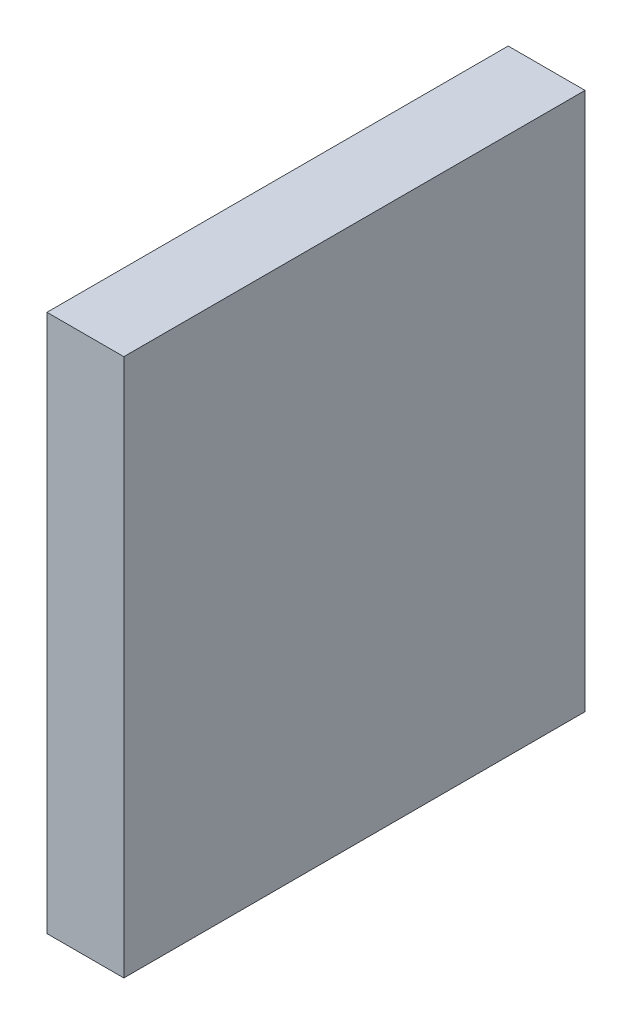
ISO-10303-21;
HEADER;
FILE_DESCRIPTION(('STEP AP214'),'2;1');
FILE_NAME('part.step','',(''),(''),'','','');
FILE_SCHEMA(('AUTOMOTIVE_DESIGN { 1 0 10303 214 1 1 1 1 }'));
ENDSEC;
DATA;
#1=APPLICATION_CONTEXT('core data for automotive mechanical design processes');
#2=APPLICATION_PROTOCOL_DEFINITION('international standard','automotive_design',2000,#1);
#3=PRODUCT_CONTEXT('',#1,'mechanical');
#4=PRODUCT('Part','Part','',(#3));
#5=PRODUCT_RELATED_PRODUCT_CATEGORY('part','',(#4));
#6=PRODUCT_DEFINITION_FORMATION('','',#4);
#7=PRODUCT_DEFINITION_CONTEXT('part definition',#1,'design');
#8=PRODUCT_DEFINITION('design','',#6,#7);
#9=PRODUCT_DEFINITION_SHAPE('','',#8);
#10=(LENGTH_UNIT() NAMED_UNIT(*) SI_UNIT(.MILLI.,.METRE.));
#11=(NAMED_UNIT(*) PLANE_ANGLE_UNIT() SI_UNIT($,.RADIAN.));
#12=(NAMED_UNIT(*) SI_UNIT($,.STERADIAN.) SOLID_ANGLE_UNIT());
#13=UNCERTAINTY_MEASURE_WITH_UNIT(LENGTH_MEASURE(1.E-05),#10,'distance_accuracy_value','');
#14=(GEOMETRIC_REPRESENTATION_CONTEXT(3) GLOBAL_UNCERTAINTY_ASSIGNED_CONTEXT((#13)) GLOBAL_UNIT_ASSIGNED_CONTEXT((#10,
#11,#12)) REPRESENTATION_CONTEXT('',''));
#15=CARTESIAN_POINT('',(0.,0.,0.));
#16=DIRECTION('',(0.,0.,1.));
#17=DIRECTION('',(1.,0.,0.));
#18=AXIS2_PLACEMENT_3D('',#15,#16,#17);
#19=CARTESIAN_POINT('',(25.5,1.87,14.26));
#20=DIRECTION('',(1.,0.,0.));
#21=DIRECTION('',(0.,0.,-1.));
#22=AXIS2_PLACEMENT_3D('',#19,#20,#21);
#23=PLANE('',#22);
#24=DIRECTION('',(0.,0.,1.));
#25=VECTOR('',#24,1.);
#26=CARTESIAN_POINT('',(25.5,2.22,13.96));
#27=LINE('',#26,#25);
#28=CARTESIAN_POINT('',(25.5,2.22,13.96));
#29=VERTEX_POINT('',#28);
#30=CARTESIAN_POINT('',(25.5,2.22,14.56));
#31=VERTEX_POINT('',#30);
#32=EDGE_CURVE('E79',#29,#31,#27,.T.);
#33=ORIENTED_EDGE('',*,*,#32,.F.);
#34=DIRECTION('',(0.,1.,0.));
#35=VECTOR('',#34,1.);
#36=CARTESIAN_POINT('',(25.5,1.52,13.96));
#37=LINE('',#36,#35);
#38=CARTESIAN_POINT('',(25.5,1.52,13.96));
#39=VERTEX_POINT('',#38);
#40=EDGE_CURVE('E55',#39,#29,#37,.T.);
#41=ORIENTED_EDGE('',*,*,#40,.F.);
#42=DIRECTION('',(0.,0.,-1.));
#43=VECTOR('',#42,1.);
#44=CARTESIAN_POINT('',(25.5,1.52,14.56));
#45=LINE('',#44,#43);
#46=CARTESIAN_POINT('',(25.5,1.52,14.56));
#47=VERTEX_POINT('',#46);
#48=EDGE_CURVE('E57',#47,#39,#45,.T.);
#49=ORIENTED_EDGE('',*,*,#48,.F.);
#50=DIRECTION('',(0.,1.,0.));
#51=VECTOR('',#50,1.);
#52=CARTESIAN_POINT('',(25.5,2.22,14.56));
#53=LINE('',#52,#51);
#54=EDGE_CURVE('E20',#31,#47,#53,.F.);
#55=ORIENTED_EDGE('',*,*,#54,.F.);
#56=EDGE_LOOP('',(#33,#41,#49,#55));
#57=FACE_BOUND('',#56,.T.);
#58=ADVANCED_FACE('F17',(#57),#23,.F.);
#59=CARTESIAN_POINT('',(25.5,2.22,14.56));
#60=DIRECTION('',(0.,0.,1.));
#61=DIRECTION('',(1.,0.,0.));
#62=AXIS2_PLACEMENT_3D('',#59,#60,#61);
#63=PLANE('',#62);
#64=DIRECTION('',(0.,1.,0.));
#65=VECTOR('',#64,1.);
#66=CARTESIAN_POINT('',(25.6,1.87,14.56));
#67=LINE('',#66,#65);
#68=CARTESIAN_POINT('',(25.6,2.22,14.56));
#69=VERTEX_POINT('',#68);
#70=CARTESIAN_POINT('',(25.6,1.52,14.56));
#71=VERTEX_POINT('',#70);
#72=EDGE_CURVE('E83',#69,#71,#67,.F.);
#73=ORIENTED_EDGE('',*,*,#72,.F.);
#74=DIRECTION('',(1.,0.,0.));
#75=VECTOR('',#74,1.);
#76=CARTESIAN_POINT('',(25.5,2.22,14.56));
#77=LINE('',#76,#75);
#78=EDGE_CURVE('E68',#31,#69,#77,.T.);
#79=ORIENTED_EDGE('',*,*,#78,.F.);
#80=ORIENTED_EDGE('',*,*,#54,.T.);
#81=DIRECTION('',(1.,0.,0.));
#82=VECTOR('',#81,1.);
#83=CARTESIAN_POINT('',(25.5,1.52,14.56));
#84=LINE('',#83,#82);
#85=EDGE_CURVE('E63',#71,#47,#84,.F.);
#86=ORIENTED_EDGE('',*,*,#85,.F.);
#87=EDGE_LOOP('',(#73,#79,#80,#86));
#88=FACE_BOUND('',#87,.T.);
#89=ADVANCED_FACE('F65',(#88),#63,.T.);
#90=CARTESIAN_POINT('',(25.5,1.52,14.56));
#91=DIRECTION('',(0.,-1.,0.));
#92=DIRECTION('',(0.,0.,-1.));
#93=AXIS2_PLACEMENT_3D('',#90,#91,#92);
#94=PLANE('',#93);
#95=DIRECTION('',(0.,0.,-1.));
#96=VECTOR('',#95,1.);
#97=CARTESIAN_POINT('',(25.6,1.52,14.26));
#98=LINE('',#97,#96);
#99=CARTESIAN_POINT('',(25.6,1.52,13.96));
#100=VERTEX_POINT('',#99);
#101=EDGE_CURVE('E72',#71,#100,#98,.T.);
#102=ORIENTED_EDGE('',*,*,#101,.F.);
#103=ORIENTED_EDGE('',*,*,#85,.T.);
#104=ORIENTED_EDGE('',*,*,#48,.T.);
#105=DIRECTION('',(-1.,0.,0.));
#106=VECTOR('',#105,1.);
#107=CARTESIAN_POINT('',(25.5,1.52,13.96));
#108=LINE('',#107,#106);
#109=EDGE_CURVE('E75',#100,#39,#108,.T.);
#110=ORIENTED_EDGE('',*,*,#109,.F.);
#111=EDGE_LOOP('',(#102,#103,#104,#110));
#112=FACE_BOUND('',#111,.T.);
#113=ADVANCED_FACE('F70',(#112),#94,.T.);
#114=CARTESIAN_POINT('',(25.5,1.52,13.96));
#115=DIRECTION('',(0.,0.,-1.));
#116=DIRECTION('',(-1.,0.,0.));
#117=AXIS2_PLACEMENT_3D('',#114,#115,#116);
#118=PLANE('',#117);
#119=DIRECTION('',(0.,1.,0.));
#120=VECTOR('',#119,1.);
#121=CARTESIAN_POINT('',(25.6,1.87,13.96));
#122=LINE('',#121,#120);
#123=CARTESIAN_POINT('',(25.6,2.22,13.96));
#124=VERTEX_POINT('',#123);
#125=EDGE_CURVE('E26',#100,#124,#122,.T.);
#126=ORIENTED_EDGE('',*,*,#125,.F.);
#127=ORIENTED_EDGE('',*,*,#109,.T.);
#128=ORIENTED_EDGE('',*,*,#40,.T.);
#129=DIRECTION('',(1.,0.,0.));
#130=VECTOR('',#129,1.);
#131=CARTESIAN_POINT('',(25.5,2.22,13.96));
#132=LINE('',#131,#130);
#133=EDGE_CURVE('E35',#124,#29,#132,.F.);
#134=ORIENTED_EDGE('',*,*,#133,.F.);
#135=EDGE_LOOP('',(#126,#127,#128,#134));
#136=FACE_BOUND('',#135,.T.);
#137=ADVANCED_FACE('F89',(#136),#118,.T.);
#138=CARTESIAN_POINT('',(25.5,2.22,13.96));
#139=DIRECTION('',(0.,1.,0.));
#140=DIRECTION('',(0.,0.,1.));
#141=AXIS2_PLACEMENT_3D('',#138,#139,#140);
#142=PLANE('',#141);
#143=DIRECTION('',(0.,0.,-1.));
#144=VECTOR('',#143,1.);
#145=CARTESIAN_POINT('',(25.6,2.22,14.26));
#146=LINE('',#145,#144);
#147=EDGE_CURVE('E11',#124,#69,#146,.F.);
#148=ORIENTED_EDGE('',*,*,#147,.F.);
#149=ORIENTED_EDGE('',*,*,#133,.T.);
#150=ORIENTED_EDGE('',*,*,#32,.T.);
#151=ORIENTED_EDGE('',*,*,#78,.T.);
#152=EDGE_LOOP('',(#148,#149,#150,#151));
#153=FACE_BOUND('',#152,.T.);
#154=ADVANCED_FACE('F91',(#153),#142,.T.);
#155=CARTESIAN_POINT('',(25.6,1.87,14.26));
#156=DIRECTION('',(1.,0.,0.));
#157=DIRECTION('',(0.,0.,-1.));
#158=AXIS2_PLACEMENT_3D('',#155,#156,#157);
#159=PLANE('',#158);
#160=ORIENTED_EDGE('',*,*,#125,.T.);
#161=ORIENTED_EDGE('',*,*,#147,.T.);
#162=ORIENTED_EDGE('',*,*,#72,.T.);
#163=ORIENTED_EDGE('',*,*,#101,.T.);
#164=EDGE_LOOP('',(#160,#161,#162,#163));
#165=FACE_BOUND('',#164,.T.);
#166=ADVANCED_FACE('F88',(#165),#159,.T.);
#167=CLOSED_SHELL('',(#58,#89,#113,#137,#154,#166));
#168=MANIFOLD_SOLID_BREP('B1',#167);
#169=ADVANCED_BREP_SHAPE_REPRESENTATION('',(#18,#168),#14);
#170=SHAPE_DEFINITION_REPRESENTATION(#9,#169);
ENDSEC;
END-ISO-10303-21;
